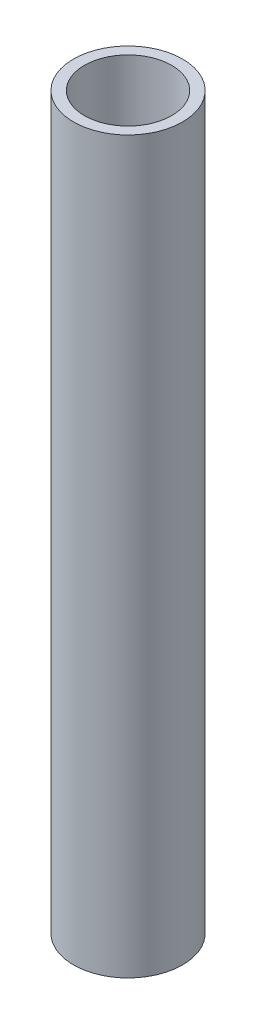
ISO-10303-21;
HEADER;
FILE_DESCRIPTION(('STEP AP214'),'2;1');
FILE_NAME('part.step','',(''),(''),'','','');
FILE_SCHEMA(('AUTOMOTIVE_DESIGN { 1 0 10303 214 1 1 1 1 }'));
ENDSEC;
DATA;
#1=APPLICATION_CONTEXT('core data for automotive mechanical design processes');
#2=APPLICATION_PROTOCOL_DEFINITION('international standard','automotive_design',2000,#1);
#3=PRODUCT_CONTEXT('',#1,'mechanical');
#4=PRODUCT('Part','Part','',(#3));
#5=PRODUCT_RELATED_PRODUCT_CATEGORY('part','',(#4));
#6=PRODUCT_DEFINITION_FORMATION('','',#4);
#7=PRODUCT_DEFINITION_CONTEXT('part definition',#1,'design');
#8=PRODUCT_DEFINITION('design','',#6,#7);
#9=PRODUCT_DEFINITION_SHAPE('','',#8);
#10=(LENGTH_UNIT() NAMED_UNIT(*) SI_UNIT(.MILLI.,.METRE.));
#11=(NAMED_UNIT(*) PLANE_ANGLE_UNIT() SI_UNIT($,.RADIAN.));
#12=(NAMED_UNIT(*) SI_UNIT($,.STERADIAN.) SOLID_ANGLE_UNIT());
#13=UNCERTAINTY_MEASURE_WITH_UNIT(LENGTH_MEASURE(1.E-05),#10,'distance_accuracy_value','');
#14=(GEOMETRIC_REPRESENTATION_CONTEXT(3) GLOBAL_UNCERTAINTY_ASSIGNED_CONTEXT((#13)) GLOBAL_UNIT_ASSIGNED_CONTEXT((#10,
#11,#12)) REPRESENTATION_CONTEXT('',''));
#15=CARTESIAN_POINT('',(0.,0.,0.));
#16=DIRECTION('',(0.,0.,1.));
#17=DIRECTION('',(1.,0.,0.));
#18=AXIS2_PLACEMENT_3D('',#15,#16,#17);
#19=CARTESIAN_POINT('',(0.,0.,0.));
#20=DIRECTION('',(0.,-1.,0.));
#21=DIRECTION('',(0.,0.,-1.));
#22=AXIS2_PLACEMENT_3D('',#19,#20,#21);
#23=CYLINDRICAL_SURFACE('',#22,5.);
#24=CARTESIAN_POINT('',(0.,0.,0.));
#25=DIRECTION('',(0.,-1.,0.));
#26=DIRECTION('',(0.,0.,-1.));
#27=AXIS2_PLACEMENT_3D('',#24,#25,#26);
#28=CIRCLE('',#27,5.);
#29=CARTESIAN_POINT('',(0.,0.,-5.));
#30=VERTEX_POINT('',#29);
#31=EDGE_CURVE('E10',#30,#30,#28,.T.);
#32=ORIENTED_EDGE('',*,*,#31,.T.);
#33=EDGE_LOOP('',(#32));
#34=FACE_BOUND('',#33,.T.);
#35=CARTESIAN_POINT('',(0.,10.,0.));
#36=DIRECTION('',(0.,-1.,0.));
#37=DIRECTION('',(0.,0.,-1.));
#38=AXIS2_PLACEMENT_3D('',#35,#36,#37);
#39=CIRCLE('',#38,5.);
#40=CARTESIAN_POINT('',(0.,10.,-5.));
#41=VERTEX_POINT('',#40);
#42=EDGE_CURVE('E54',#41,#41,#39,.T.);
#43=ORIENTED_EDGE('',*,*,#42,.F.);
#44=EDGE_LOOP('',(#43));
#45=FACE_BOUND('',#44,.T.);
#46=ADVANCED_FACE('F32',(#34,#45),#23,.F.);
#47=CARTESIAN_POINT('',(0.,0.,-5.));
#48=DIRECTION('',(0.,-1.,0.));
#49=DIRECTION('',(0.,0.,-1.));
#50=AXIS2_PLACEMENT_3D('',#47,#48,#49);
#51=PLANE('',#50);
#52=CARTESIAN_POINT('',(0.,0.,0.));
#53=DIRECTION('',(0.,-1.,0.));
#54=DIRECTION('',(0.,0.,-1.));
#55=AXIS2_PLACEMENT_3D('',#52,#53,#54);
#56=CIRCLE('',#55,15.);
#57=CARTESIAN_POINT('',(0.,0.,-15.));
#58=VERTEX_POINT('',#57);
#59=EDGE_CURVE('E38',#58,#58,#56,.T.);
#60=ORIENTED_EDGE('',*,*,#59,.T.);
#61=EDGE_LOOP('',(#60));
#62=FACE_BOUND('',#61,.T.);
#63=ORIENTED_EDGE('',*,*,#31,.F.);
#64=EDGE_LOOP('',(#63));
#65=FACE_BOUND('',#64,.T.);
#66=ADVANCED_FACE('F62',(#62,#65),#51,.T.);
#67=CARTESIAN_POINT('',(0.,0.,0.));
#68=DIRECTION('',(0.,-1.,0.));
#69=DIRECTION('',(0.,0.,-1.));
#70=AXIS2_PLACEMENT_3D('',#67,#68,#69);
#71=CYLINDRICAL_SURFACE('',#70,15.);
#72=CARTESIAN_POINT('',(0.,200.817203122274,0.));
#73=DIRECTION('',(0.,-1.,0.));
#74=DIRECTION('',(0.,0.,-1.));
#75=AXIS2_PLACEMENT_3D('',#72,#73,#74);
#76=CIRCLE('',#75,15.);
#77=CARTESIAN_POINT('',(0.,200.817203122274,-15.));
#78=VERTEX_POINT('',#77);
#79=EDGE_CURVE('E42',#78,#78,#76,.T.);
#80=ORIENTED_EDGE('',*,*,#79,.T.);
#81=EDGE_LOOP('',(#80));
#82=FACE_BOUND('',#81,.T.);
#83=ORIENTED_EDGE('',*,*,#59,.F.);
#84=EDGE_LOOP('',(#83));
#85=FACE_BOUND('',#84,.T.);
#86=ADVANCED_FACE('F66',(#82,#85),#71,.T.);
#87=CARTESIAN_POINT('',(0.,200.817203122274,-15.));
#88=DIRECTION('',(0.,1.,0.));
#89=DIRECTION('',(0.,0.,1.));
#90=AXIS2_PLACEMENT_3D('',#87,#88,#89);
#91=PLANE('',#90);
#92=CARTESIAN_POINT('',(0.,200.817203122274,0.));
#93=DIRECTION('',(0.,-1.,0.));
#94=DIRECTION('',(0.,0.,-1.));
#95=AXIS2_PLACEMENT_3D('',#92,#93,#94);
#96=CIRCLE('',#95,12.);
#97=CARTESIAN_POINT('',(0.,200.817203122274,-12.));
#98=VERTEX_POINT('',#97);
#99=EDGE_CURVE('E46',#98,#98,#96,.T.);
#100=ORIENTED_EDGE('',*,*,#99,.T.);
#101=EDGE_LOOP('',(#100));
#102=FACE_BOUND('',#101,.T.);
#103=ORIENTED_EDGE('',*,*,#79,.F.);
#104=EDGE_LOOP('',(#103));
#105=FACE_BOUND('',#104,.T.);
#106=ADVANCED_FACE('F70',(#102,#105),#91,.T.);
#107=CARTESIAN_POINT('',(0.,0.,0.));
#108=DIRECTION('',(0.,-1.,0.));
#109=DIRECTION('',(0.,0.,-1.));
#110=AXIS2_PLACEMENT_3D('',#107,#108,#109);
#111=CYLINDRICAL_SURFACE('',#110,12.);
#112=CARTESIAN_POINT('',(0.,10.,0.));
#113=DIRECTION('',(0.,-1.,0.));
#114=DIRECTION('',(0.,0.,-1.));
#115=AXIS2_PLACEMENT_3D('',#112,#113,#114);
#116=CIRCLE('',#115,12.);
#117=CARTESIAN_POINT('',(0.,10.,-12.));
#118=VERTEX_POINT('',#117);
#119=EDGE_CURVE('E51',#118,#118,#116,.T.);
#120=ORIENTED_EDGE('',*,*,#119,.T.);
#121=EDGE_LOOP('',(#120));
#122=FACE_BOUND('',#121,.T.);
#123=ORIENTED_EDGE('',*,*,#99,.F.);
#124=EDGE_LOOP('',(#123));
#125=FACE_BOUND('',#124,.T.);
#126=ADVANCED_FACE('F77',(#122,#125),#111,.F.);
#127=CARTESIAN_POINT('',(0.,10.,-12.));
#128=DIRECTION('',(0.,1.,0.));
#129=DIRECTION('',(0.,0.,1.));
#130=AXIS2_PLACEMENT_3D('',#127,#128,#129);
#131=PLANE('',#130);
#132=ORIENTED_EDGE('',*,*,#42,.T.);
#133=EDGE_LOOP('',(#132));
#134=FACE_BOUND('',#133,.T.);
#135=ORIENTED_EDGE('',*,*,#119,.F.);
#136=EDGE_LOOP('',(#135));
#137=FACE_BOUND('',#136,.T.);
#138=ADVANCED_FACE('F58',(#134,#137),#131,.T.);
#139=CLOSED_SHELL('',(#46,#66,#86,#106,#126,#138));
#140=MANIFOLD_SOLID_BREP('B2',#139);
#141=ADVANCED_BREP_SHAPE_REPRESENTATION('',(#18,#140),#14);
#142=SHAPE_DEFINITION_REPRESENTATION(#9,#141);
ENDSEC;
END-ISO-10303-21;
